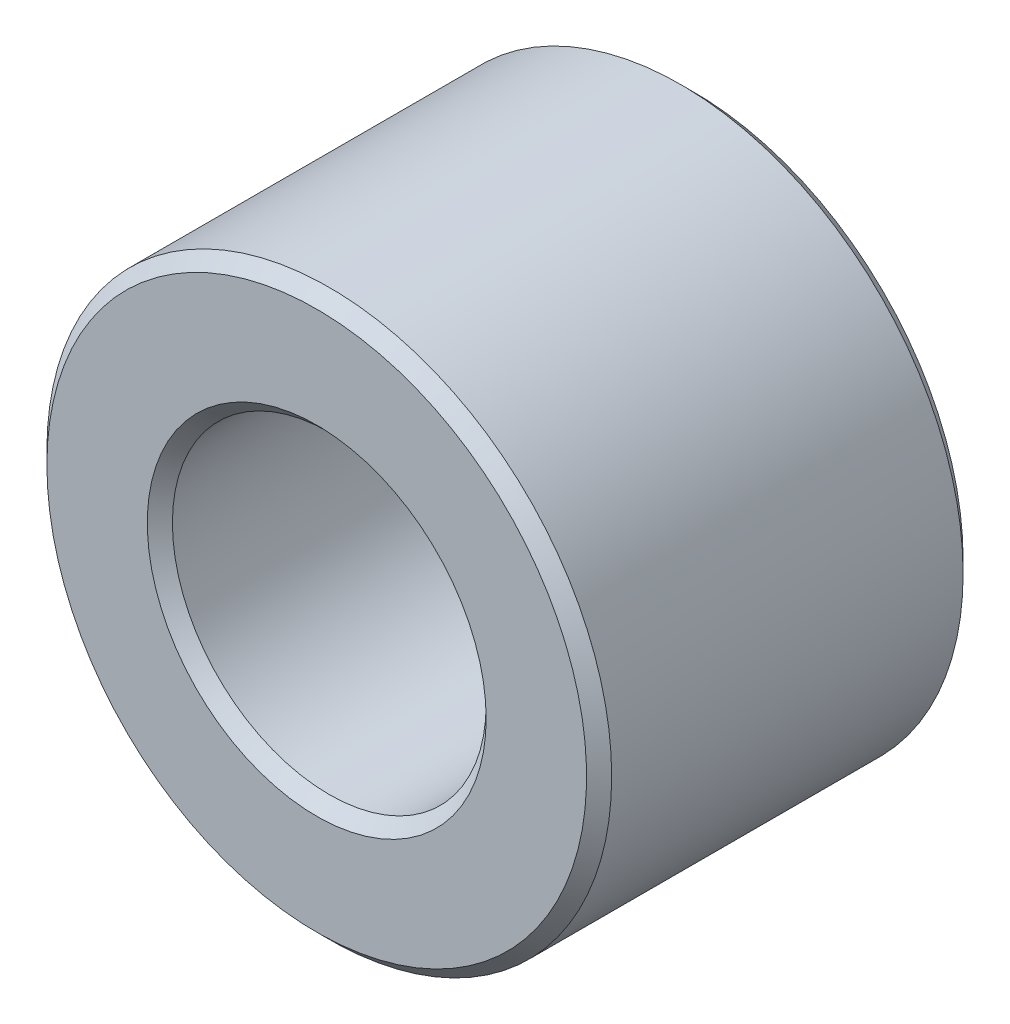
ISO-10303-21;
HEADER;
FILE_DESCRIPTION(('STEP AP214'),'2;1');
FILE_NAME('part.step','',(''),(''),'','','');
FILE_SCHEMA(('AUTOMOTIVE_DESIGN { 1 0 10303 214 1 1 1 1 }'));
ENDSEC;
DATA;
#1=APPLICATION_CONTEXT('core data for automotive mechanical design processes');
#2=APPLICATION_PROTOCOL_DEFINITION('international standard','automotive_design',2000,#1);
#3=PRODUCT_CONTEXT('',#1,'mechanical');
#4=PRODUCT('Part','Part','',(#3));
#5=PRODUCT_RELATED_PRODUCT_CATEGORY('part','',(#4));
#6=PRODUCT_DEFINITION_FORMATION('','',#4);
#7=PRODUCT_DEFINITION_CONTEXT('part definition',#1,'design');
#8=PRODUCT_DEFINITION('design','',#6,#7);
#9=PRODUCT_DEFINITION_SHAPE('','',#8);
#10=(LENGTH_UNIT() NAMED_UNIT(*) SI_UNIT(.MILLI.,.METRE.));
#11=(NAMED_UNIT(*) PLANE_ANGLE_UNIT() SI_UNIT($,.RADIAN.));
#12=(NAMED_UNIT(*) SI_UNIT($,.STERADIAN.) SOLID_ANGLE_UNIT());
#13=UNCERTAINTY_MEASURE_WITH_UNIT(LENGTH_MEASURE(1.E-05),#10,'distance_accuracy_value','');
#14=(GEOMETRIC_REPRESENTATION_CONTEXT(3) GLOBAL_UNCERTAINTY_ASSIGNED_CONTEXT((#13)) GLOBAL_UNIT_ASSIGNED_CONTEXT((#10,
#11,#12)) REPRESENTATION_CONTEXT('',''));
#15=CARTESIAN_POINT('',(0.,0.,0.));
#16=DIRECTION('',(0.,0.,1.));
#17=DIRECTION('',(1.,0.,0.));
#18=AXIS2_PLACEMENT_3D('',#15,#16,#17);
#19=CARTESIAN_POINT('',(0.,0.,0.));
#20=DIRECTION('',(0.,0.,1.));
#21=DIRECTION('',(1.,0.,0.));
#22=AXIS2_PLACEMENT_3D('',#19,#20,#21);
#23=CYLINDRICAL_SURFACE('',#22,1.25);
#24=CARTESIAN_POINT('',(0.,0.,0.100000000031741));
#25=DIRECTION('',(0.,0.,-1.));
#26=DIRECTION('',(-1.,0.,0.));
#27=AXIS2_PLACEMENT_3D('',#24,#25,#26);
#28=CIRCLE('',#27,1.24999999997044);
#29=CARTESIAN_POINT('',(-1.24999999997044,0.,0.100000000031741));
#30=VERTEX_POINT('',#29);
#31=EDGE_CURVE('E33',#30,#30,#28,.T.);
#32=ORIENTED_EDGE('',*,*,#31,.T.);
#33=EDGE_LOOP('',(#32));
#34=FACE_BOUND('',#33,.T.);
#35=CARTESIAN_POINT('',(0.,0.,2.900000000011));
#36=DIRECTION('',(0.,0.,1.));
#37=DIRECTION('',(-1.,0.,0.));
#38=AXIS2_PLACEMENT_3D('',#35,#36,#37);
#39=CIRCLE('',#38,1.24999999997044);
#40=CARTESIAN_POINT('',(-1.24999999997044,0.,2.900000000011));
#41=VERTEX_POINT('',#40);
#42=EDGE_CURVE('E36',#41,#41,#39,.T.);
#43=ORIENTED_EDGE('',*,*,#42,.T.);
#44=EDGE_LOOP('',(#43));
#45=FACE_BOUND('',#44,.T.);
#46=ADVANCED_FACE('F14',(#34,#45),#23,.F.);
#47=CARTESIAN_POINT('',(0.,0.,2.99999999992906));
#48=DIRECTION('',(0.,0.,1.));
#49=DIRECTION('',(1.,0.,0.));
#50=AXIS2_PLACEMENT_3D('',#47,#48,#49);
#51=CONICAL_SURFACE('',#50,1.34999999994534,0.785398163397448);
#52=CARTESIAN_POINT('',(0.,0.,2.99999999998591));
#53=DIRECTION('',(0.,0.,1.));
#54=DIRECTION('',(1.,0.,0.));
#55=AXIS2_PLACEMENT_3D('',#52,#53,#54);
#56=CIRCLE('',#55,1.35000000000218);
#57=CARTESIAN_POINT('',(1.35000000000218,0.,2.99999999998591));
#58=VERTEX_POINT('',#57);
#59=EDGE_CURVE('E17',#58,#58,#56,.T.);
#60=ORIENTED_EDGE('',*,*,#59,.T.);
#61=EDGE_LOOP('',(#60));
#62=FACE_BOUND('',#61,.T.);
#63=ORIENTED_EDGE('',*,*,#42,.F.);
#64=EDGE_LOOP('',(#63));
#65=FACE_BOUND('',#64,.T.);
#66=ADVANCED_FACE('F54',(#62,#65),#51,.F.);
#67=CARTESIAN_POINT('',(0.,0.,1.13686837721616E-10));
#68=DIRECTION('',(0.,0.,-1.));
#69=DIRECTION('',(-1.,0.,0.));
#70=AXIS2_PLACEMENT_3D('',#67,#68,#69);
#71=CONICAL_SURFACE('',#70,1.34999999994534,0.785398163397448);
#72=CARTESIAN_POINT('',(0.,0.,0.));
#73=DIRECTION('',(0.,0.,-1.));
#74=DIRECTION('',(-1.,0.,0.));
#75=AXIS2_PLACEMENT_3D('',#72,#73,#74);
#76=CIRCLE('',#75,1.35000000005903);
#77=CARTESIAN_POINT('',(-1.35000000005903,0.,0.));
#78=VERTEX_POINT('',#77);
#79=EDGE_CURVE('E47',#78,#78,#76,.F.);
#80=ORIENTED_EDGE('',*,*,#79,.F.);
#81=EDGE_LOOP('',(#80));
#82=FACE_BOUND('',#81,.T.);
#83=ORIENTED_EDGE('',*,*,#31,.F.);
#84=EDGE_LOOP('',(#83));
#85=FACE_BOUND('',#84,.T.);
#86=ADVANCED_FACE('F61',(#82,#85),#71,.F.);
#87=CARTESIAN_POINT('',(0.,0.,3.));
#88=DIRECTION('',(0.,0.,-1.));
#89=DIRECTION('',(-1.,0.,0.));
#90=AXIS2_PLACEMENT_3D('',#87,#88,#89);
#91=PLANE('',#90);
#92=ORIENTED_EDGE('',*,*,#59,.F.);
#93=EDGE_LOOP('',(#92));
#94=FACE_BOUND('',#93,.T.);
#95=CARTESIAN_POINT('',(0.,0.,2.99999999992906));
#96=DIRECTION('',(0.,0.,-1.));
#97=DIRECTION('',(-1.,0.,0.));
#98=AXIS2_PLACEMENT_3D('',#95,#96,#97);
#99=CIRCLE('',#98,2.15000000002874);
#100=CARTESIAN_POINT('',(-2.15000000002874,0.,2.99999999992906));
#101=VERTEX_POINT('',#100);
#102=EDGE_CURVE('E45',#101,#101,#99,.T.);
#103=ORIENTED_EDGE('',*,*,#102,.F.);
#104=EDGE_LOOP('',(#103));
#105=FACE_BOUND('',#104,.T.);
#106=ADVANCED_FACE('F57',(#94,#105),#91,.F.);
#107=CARTESIAN_POINT('',(0.,0.,0.));
#108=DIRECTION('',(0.,0.,-1.));
#109=DIRECTION('',(-1.,0.,0.));
#110=AXIS2_PLACEMENT_3D('',#107,#108,#109);
#111=PLANE('',#110);
#112=ORIENTED_EDGE('',*,*,#79,.T.);
#113=EDGE_LOOP('',(#112));
#114=FACE_BOUND('',#113,.T.);
#115=CARTESIAN_POINT('',(0.,0.,5.6843418860808E-11));
#116=DIRECTION('',(0.,0.,1.));
#117=DIRECTION('',(1.,0.,0.));
#118=AXIS2_PLACEMENT_3D('',#115,#116,#117);
#119=CIRCLE('',#118,2.15000000002874);
#120=CARTESIAN_POINT('',(2.15000000002874,0.,5.6843418860808E-11));
#121=VERTEX_POINT('',#120);
#122=EDGE_CURVE('E26',#121,#121,#119,.T.);
#123=ORIENTED_EDGE('',*,*,#122,.F.);
#124=EDGE_LOOP('',(#123));
#125=FACE_BOUND('',#124,.T.);
#126=ADVANCED_FACE('F60',(#114,#125),#111,.T.);
#127=CARTESIAN_POINT('',(0.,0.,2.90000000012469));
#128=DIRECTION('',(0.,0.,-1.));
#129=DIRECTION('',(-1.,0.,0.));
#130=AXIS2_PLACEMENT_3D('',#127,#128,#129);
#131=CONICAL_SURFACE('',#130,2.24999999988995,0.785398163681665);
#132=CARTESIAN_POINT('',(0.,0.,2.9));
#133=DIRECTION('',(0.,0.,1.));
#134=DIRECTION('',(1.,0.,0.));
#135=AXIS2_PLACEMENT_3D('',#132,#133,#134);
#136=CIRCLE('',#135,2.25);
#137=CARTESIAN_POINT('',(2.25,0.,2.9));
#138=VERTEX_POINT('',#137);
#139=EDGE_CURVE('E21',#138,#138,#136,.F.);
#140=ORIENTED_EDGE('',*,*,#139,.F.);
#141=EDGE_LOOP('',(#140));
#142=FACE_BOUND('',#141,.T.);
#143=ORIENTED_EDGE('',*,*,#102,.T.);
#144=EDGE_LOOP('',(#143));
#145=FACE_BOUND('',#144,.T.);
#146=ADVANCED_FACE('F65',(#142,#145),#131,.T.);
#147=CARTESIAN_POINT('',(0.,0.,0.0999999999180545));
#148=DIRECTION('',(0.,0.,1.));
#149=DIRECTION('',(1.,0.,0.));
#150=AXIS2_PLACEMENT_3D('',#147,#148,#149);
#151=CONICAL_SURFACE('',#150,2.2499999999468,0.785398163681665);
#152=ORIENTED_EDGE('',*,*,#122,.T.);
#153=EDGE_LOOP('',(#152));
#154=FACE_BOUND('',#153,.T.);
#155=CARTESIAN_POINT('',(0.,0.,0.1));
#156=DIRECTION('',(0.,0.,1.));
#157=DIRECTION('',(1.,0.,0.));
#158=AXIS2_PLACEMENT_3D('',#155,#156,#157);
#159=CIRCLE('',#158,2.25);
#160=CARTESIAN_POINT('',(2.25,0.,0.1));
#161=VERTEX_POINT('',#160);
#162=EDGE_CURVE('E9',#161,#161,#159,.T.);
#163=ORIENTED_EDGE('',*,*,#162,.F.);
#164=EDGE_LOOP('',(#163));
#165=FACE_BOUND('',#164,.T.);
#166=ADVANCED_FACE('F67',(#154,#165),#151,.T.);
#167=CARTESIAN_POINT('',(0.,0.,0.));
#168=DIRECTION('',(0.,0.,1.));
#169=DIRECTION('',(1.,0.,0.));
#170=AXIS2_PLACEMENT_3D('',#167,#168,#169);
#171=CYLINDRICAL_SURFACE('',#170,2.25);
#172=ORIENTED_EDGE('',*,*,#162,.T.);
#173=EDGE_LOOP('',(#172));
#174=FACE_BOUND('',#173,.T.);
#175=ORIENTED_EDGE('',*,*,#139,.T.);
#176=EDGE_LOOP('',(#175));
#177=FACE_BOUND('',#176,.T.);
#178=ADVANCED_FACE('F76',(#174,#177),#171,.T.);
#179=CLOSED_SHELL('',(#46,#66,#86,#106,#126,#146,#166,#178));
#180=MANIFOLD_SOLID_BREP('B1',#179);
#181=ADVANCED_BREP_SHAPE_REPRESENTATION('',(#18,#180),#14);
#182=SHAPE_DEFINITION_REPRESENTATION(#9,#181);
ENDSEC;
END-ISO-10303-21;
